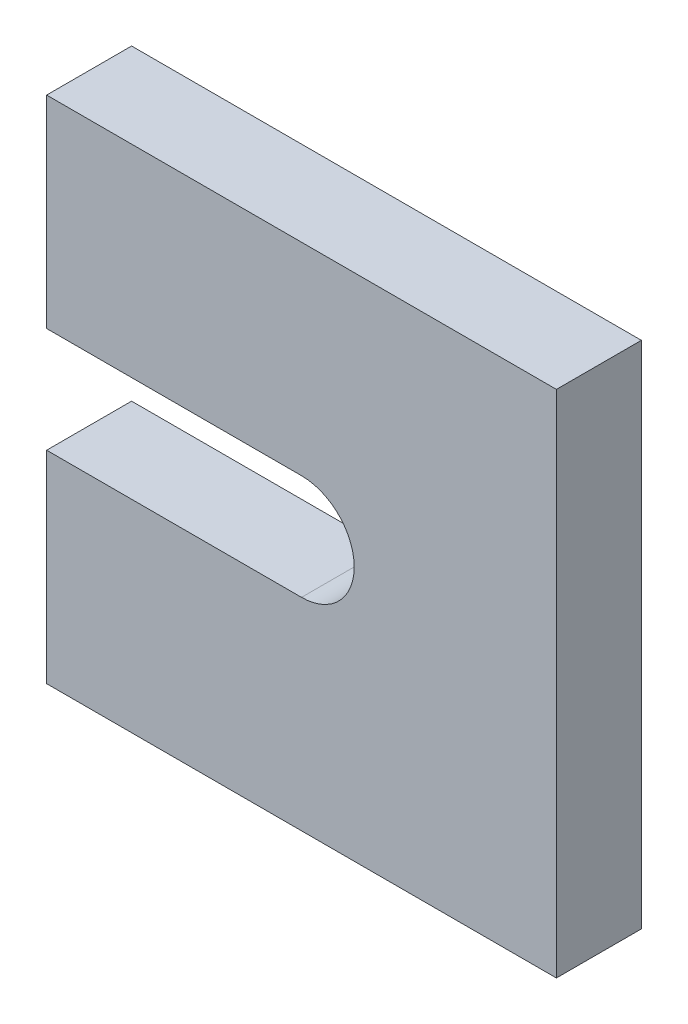
ISO-10303-21;
HEADER;
FILE_DESCRIPTION(('STEP AP214'),'2;1');
FILE_NAME('part.step','',(''),(''),'','','');
FILE_SCHEMA(('AUTOMOTIVE_DESIGN { 1 0 10303 214 1 1 1 1 }'));
ENDSEC;
DATA;
#1=APPLICATION_CONTEXT('core data for automotive mechanical design processes');
#2=APPLICATION_PROTOCOL_DEFINITION('international standard','automotive_design',2000,#1);
#3=PRODUCT_CONTEXT('',#1,'mechanical');
#4=PRODUCT('Part','Part','',(#3));
#5=PRODUCT_RELATED_PRODUCT_CATEGORY('part','',(#4));
#6=PRODUCT_DEFINITION_FORMATION('','',#4);
#7=PRODUCT_DEFINITION_CONTEXT('part definition',#1,'design');
#8=PRODUCT_DEFINITION('design','',#6,#7);
#9=PRODUCT_DEFINITION_SHAPE('','',#8);
#10=(LENGTH_UNIT() NAMED_UNIT(*) SI_UNIT(.MILLI.,.METRE.));
#11=(NAMED_UNIT(*) PLANE_ANGLE_UNIT() SI_UNIT($,.RADIAN.));
#12=(NAMED_UNIT(*) SI_UNIT($,.STERADIAN.) SOLID_ANGLE_UNIT());
#13=UNCERTAINTY_MEASURE_WITH_UNIT(LENGTH_MEASURE(1.E-05),#10,'distance_accuracy_value','');
#14=(GEOMETRIC_REPRESENTATION_CONTEXT(3) GLOBAL_UNCERTAINTY_ASSIGNED_CONTEXT((#13)) GLOBAL_UNIT_ASSIGNED_CONTEXT((#10,
#11,#12)) REPRESENTATION_CONTEXT('',''));
#15=CARTESIAN_POINT('',(0.,0.,0.));
#16=DIRECTION('',(0.,0.,1.));
#17=DIRECTION('',(1.,0.,0.));
#18=AXIS2_PLACEMENT_3D('',#15,#16,#17);
#19=CARTESIAN_POINT('',(0.,0.,5.));
#20=DIRECTION('',(1.,0.,0.));
#21=DIRECTION('',(0.,0.,-1.));
#22=AXIS2_PLACEMENT_3D('',#19,#20,#21);
#23=PLANE('',#22);
#24=DIRECTION('',(0.,-1.,0.));
#25=VECTOR('',#24,1.);
#26=CARTESIAN_POINT('',(0.,0.,0.));
#27=LINE('',#26,#25);
#28=CARTESIAN_POINT('',(0.,11.9,0.));
#29=VERTEX_POINT('',#28);
#30=CARTESIAN_POINT('',(0.,0.,0.));
#31=VERTEX_POINT('',#30);
#32=EDGE_CURVE('E129',#29,#31,#27,.T.);
#33=ORIENTED_EDGE('',*,*,#32,.T.);
#34=DIRECTION('',(0.,0.,-1.));
#35=VECTOR('',#34,1.);
#36=CARTESIAN_POINT('',(0.,0.,5.));
#37=LINE('',#36,#35);
#38=CARTESIAN_POINT('',(0.,0.,5.));
#39=VERTEX_POINT('',#38);
#40=EDGE_CURVE('E11',#39,#31,#37,.T.);
#41=ORIENTED_EDGE('',*,*,#40,.F.);
#42=DIRECTION('',(0.,-1.,0.));
#43=VECTOR('',#42,1.);
#44=CARTESIAN_POINT('',(0.,0.,5.));
#45=LINE('',#44,#43);
#46=CARTESIAN_POINT('',(0.,11.9,5.));
#47=VERTEX_POINT('',#46);
#48=EDGE_CURVE('E143',#47,#39,#45,.T.);
#49=ORIENTED_EDGE('',*,*,#48,.F.);
#50=DIRECTION('',(0.,0.,-1.));
#51=VECTOR('',#50,1.);
#52=CARTESIAN_POINT('',(0.,11.9,5.));
#53=LINE('',#52,#51);
#54=EDGE_CURVE('E125',#47,#29,#53,.T.);
#55=ORIENTED_EDGE('',*,*,#54,.T.);
#56=EDGE_LOOP('',(#33,#41,#49,#55));
#57=FACE_BOUND('',#56,.T.);
#58=ADVANCED_FACE('F33',(#57),#23,.F.);
#59=CARTESIAN_POINT('',(0.,0.,5.));
#60=DIRECTION('',(0.,1.,0.));
#61=DIRECTION('',(0.,0.,1.));
#62=AXIS2_PLACEMENT_3D('',#59,#60,#61);
#63=PLANE('',#62);
#64=DIRECTION('',(1.,0.,0.));
#65=VECTOR('',#64,1.);
#66=CARTESIAN_POINT('',(0.,0.,0.));
#67=LINE('',#66,#65);
#68=CARTESIAN_POINT('',(30.,0.,0.));
#69=VERTEX_POINT('',#68);
#70=EDGE_CURVE('E132',#31,#69,#67,.T.);
#71=ORIENTED_EDGE('',*,*,#70,.T.);
#72=DIRECTION('',(0.,0.,-1.));
#73=VECTOR('',#72,1.);
#74=CARTESIAN_POINT('',(30.,0.,5.));
#75=LINE('',#74,#73);
#76=CARTESIAN_POINT('',(30.,0.,5.));
#77=VERTEX_POINT('',#76);
#78=EDGE_CURVE('E41',#77,#69,#75,.T.);
#79=ORIENTED_EDGE('',*,*,#78,.F.);
#80=DIRECTION('',(1.,0.,0.));
#81=VECTOR('',#80,1.);
#82=CARTESIAN_POINT('',(0.,0.,5.));
#83=LINE('',#82,#81);
#84=EDGE_CURVE('E92',#39,#77,#83,.T.);
#85=ORIENTED_EDGE('',*,*,#84,.F.);
#86=ORIENTED_EDGE('',*,*,#40,.T.);
#87=EDGE_LOOP('',(#71,#79,#85,#86));
#88=FACE_BOUND('',#87,.T.);
#89=ADVANCED_FACE('F178',(#88),#63,.F.);
#90=CARTESIAN_POINT('',(30.,0.,5.));
#91=DIRECTION('',(-1.,0.,0.));
#92=DIRECTION('',(0.,-1.,0.));
#93=AXIS2_PLACEMENT_3D('',#90,#91,#92);
#94=PLANE('',#93);
#95=DIRECTION('',(0.,1.,0.));
#96=VECTOR('',#95,1.);
#97=CARTESIAN_POINT('',(30.,0.,0.));
#98=LINE('',#97,#96);
#99=CARTESIAN_POINT('',(30.,30.,0.));
#100=VERTEX_POINT('',#99);
#101=EDGE_CURVE('E134',#69,#100,#98,.T.);
#102=ORIENTED_EDGE('',*,*,#101,.T.);
#103=DIRECTION('',(0.,0.,-1.));
#104=VECTOR('',#103,1.);
#105=CARTESIAN_POINT('',(30.,30.,5.));
#106=LINE('',#105,#104);
#107=CARTESIAN_POINT('',(30.,30.,5.));
#108=VERTEX_POINT('',#107);
#109=EDGE_CURVE('E150',#108,#100,#106,.T.);
#110=ORIENTED_EDGE('',*,*,#109,.F.);
#111=DIRECTION('',(0.,1.,0.));
#112=VECTOR('',#111,1.);
#113=CARTESIAN_POINT('',(30.,0.,5.));
#114=LINE('',#113,#112);
#115=EDGE_CURVE('E158',#77,#108,#114,.T.);
#116=ORIENTED_EDGE('',*,*,#115,.F.);
#117=ORIENTED_EDGE('',*,*,#78,.T.);
#118=EDGE_LOOP('',(#102,#110,#116,#117));
#119=FACE_BOUND('',#118,.T.);
#120=ADVANCED_FACE('F156',(#119),#94,.F.);
#121=CARTESIAN_POINT('',(0.,30.,5.));
#122=DIRECTION('',(0.,-1.,0.));
#123=DIRECTION('',(0.,0.,-1.));
#124=AXIS2_PLACEMENT_3D('',#121,#122,#123);
#125=PLANE('',#124);
#126=DIRECTION('',(-1.,0.,0.));
#127=VECTOR('',#126,1.);
#128=CARTESIAN_POINT('',(0.,30.,0.));
#129=LINE('',#128,#127);
#130=CARTESIAN_POINT('',(0.,30.,0.));
#131=VERTEX_POINT('',#130);
#132=EDGE_CURVE('E136',#100,#131,#129,.T.);
#133=ORIENTED_EDGE('',*,*,#132,.T.);
#134=DIRECTION('',(0.,0.,-1.));
#135=VECTOR('',#134,1.);
#136=CARTESIAN_POINT('',(0.,30.,5.));
#137=LINE('',#136,#135);
#138=CARTESIAN_POINT('',(0.,30.,5.));
#139=VERTEX_POINT('',#138);
#140=EDGE_CURVE('E147',#139,#131,#137,.T.);
#141=ORIENTED_EDGE('',*,*,#140,.F.);
#142=DIRECTION('',(-1.,0.,0.));
#143=VECTOR('',#142,1.);
#144=CARTESIAN_POINT('',(0.,30.,5.));
#145=LINE('',#144,#143);
#146=EDGE_CURVE('E170',#108,#139,#145,.T.);
#147=ORIENTED_EDGE('',*,*,#146,.F.);
#148=ORIENTED_EDGE('',*,*,#109,.T.);
#149=EDGE_LOOP('',(#133,#141,#147,#148));
#150=FACE_BOUND('',#149,.T.);
#151=ADVANCED_FACE('F166',(#150),#125,.F.);
#152=CARTESIAN_POINT('',(0.,18.1,5.));
#153=DIRECTION('',(1.,0.,0.));
#154=DIRECTION('',(0.,0.,-1.));
#155=AXIS2_PLACEMENT_3D('',#152,#153,#154);
#156=PLANE('',#155);
#157=DIRECTION('',(0.,-1.,0.));
#158=VECTOR('',#157,1.);
#159=CARTESIAN_POINT('',(0.,18.1,0.));
#160=LINE('',#159,#158);
#161=CARTESIAN_POINT('',(0.,18.1,0.));
#162=VERTEX_POINT('',#161);
#163=EDGE_CURVE('E138',#131,#162,#160,.T.);
#164=ORIENTED_EDGE('',*,*,#163,.T.);
#165=DIRECTION('',(0.,0.,-1.));
#166=VECTOR('',#165,1.);
#167=CARTESIAN_POINT('',(0.,18.1,5.));
#168=LINE('',#167,#166);
#169=CARTESIAN_POINT('',(0.,18.1,5.));
#170=VERTEX_POINT('',#169);
#171=EDGE_CURVE('E120',#170,#162,#168,.T.);
#172=ORIENTED_EDGE('',*,*,#171,.F.);
#173=DIRECTION('',(0.,-1.,0.));
#174=VECTOR('',#173,1.);
#175=CARTESIAN_POINT('',(0.,18.1,5.));
#176=LINE('',#175,#174);
#177=EDGE_CURVE('E111',#139,#170,#176,.T.);
#178=ORIENTED_EDGE('',*,*,#177,.F.);
#179=ORIENTED_EDGE('',*,*,#140,.T.);
#180=EDGE_LOOP('',(#164,#172,#178,#179));
#181=FACE_BOUND('',#180,.T.);
#182=ADVANCED_FACE('F169',(#181),#156,.F.);
#183=CARTESIAN_POINT('',(15.,18.1,5.));
#184=DIRECTION('',(0.,1.,0.));
#185=DIRECTION('',(0.,0.,1.));
#186=AXIS2_PLACEMENT_3D('',#183,#184,#185);
#187=PLANE('',#186);
#188=DIRECTION('',(1.,0.,0.));
#189=VECTOR('',#188,1.);
#190=CARTESIAN_POINT('',(15.,18.1,0.));
#191=LINE('',#190,#189);
#192=CARTESIAN_POINT('',(15.,18.1,0.));
#193=VERTEX_POINT('',#192);
#194=EDGE_CURVE('E119',#162,#193,#191,.T.);
#195=ORIENTED_EDGE('',*,*,#194,.T.);
#196=DIRECTION('',(0.,0.,-1.));
#197=VECTOR('',#196,1.);
#198=CARTESIAN_POINT('',(15.,18.1,5.));
#199=LINE('',#198,#197);
#200=CARTESIAN_POINT('',(15.,18.1,5.));
#201=VERTEX_POINT('',#200);
#202=EDGE_CURVE('E116',#201,#193,#199,.T.);
#203=ORIENTED_EDGE('',*,*,#202,.F.);
#204=DIRECTION('',(1.,0.,0.));
#205=VECTOR('',#204,1.);
#206=CARTESIAN_POINT('',(15.,18.1,5.));
#207=LINE('',#206,#205);
#208=EDGE_CURVE('E105',#170,#201,#207,.T.);
#209=ORIENTED_EDGE('',*,*,#208,.F.);
#210=ORIENTED_EDGE('',*,*,#171,.T.);
#211=EDGE_LOOP('',(#195,#203,#209,#210));
#212=FACE_BOUND('',#211,.T.);
#213=ADVANCED_FACE('F117',(#212),#187,.F.);
#214=CARTESIAN_POINT('',(15.,15.,5.));
#215=DIRECTION('',(0.,0.,-1.));
#216=DIRECTION('',(-1.,0.,0.));
#217=AXIS2_PLACEMENT_3D('',#214,#215,#216);
#218=CYLINDRICAL_SURFACE('',#217,3.1);
#219=CARTESIAN_POINT('',(15.,15.,0.));
#220=DIRECTION('',(0.,0.,-1.));
#221=DIRECTION('',(1.,0.,0.));
#222=AXIS2_PLACEMENT_3D('',#219,#220,#221);
#223=CIRCLE('',#222,3.1);
#224=CARTESIAN_POINT('',(15.,11.9,0.));
#225=VERTEX_POINT('',#224);
#226=EDGE_CURVE('E78',#193,#225,#223,.T.);
#227=ORIENTED_EDGE('',*,*,#226,.T.);
#228=DIRECTION('',(0.,0.,-1.));
#229=VECTOR('',#228,1.);
#230=CARTESIAN_POINT('',(15.,11.9,5.));
#231=LINE('',#230,#229);
#232=CARTESIAN_POINT('',(15.,11.9,5.));
#233=VERTEX_POINT('',#232);
#234=EDGE_CURVE('E121',#233,#225,#231,.T.);
#235=ORIENTED_EDGE('',*,*,#234,.F.);
#236=CARTESIAN_POINT('',(15.,15.,5.));
#237=DIRECTION('',(0.,0.,-1.));
#238=DIRECTION('',(1.,0.,0.));
#239=AXIS2_PLACEMENT_3D('',#236,#237,#238);
#240=CIRCLE('',#239,3.1);
#241=EDGE_CURVE('E109',#201,#233,#240,.T.);
#242=ORIENTED_EDGE('',*,*,#241,.F.);
#243=ORIENTED_EDGE('',*,*,#202,.T.);
#244=EDGE_LOOP('',(#227,#235,#242,#243));
#245=FACE_BOUND('',#244,.T.);
#246=ADVANCED_FACE('F123',(#245),#218,.F.);
#247=CARTESIAN_POINT('',(15.,11.9,5.));
#248=DIRECTION('',(0.,-1.,0.));
#249=DIRECTION('',(0.,0.,-1.));
#250=AXIS2_PLACEMENT_3D('',#247,#248,#249);
#251=PLANE('',#250);
#252=DIRECTION('',(-1.,0.,0.));
#253=VECTOR('',#252,1.);
#254=CARTESIAN_POINT('',(15.,11.9,0.));
#255=LINE('',#254,#253);
#256=EDGE_CURVE('E84',#225,#29,#255,.T.);
#257=ORIENTED_EDGE('',*,*,#256,.T.);
#258=ORIENTED_EDGE('',*,*,#54,.F.);
#259=DIRECTION('',(-1.,0.,0.));
#260=VECTOR('',#259,1.);
#261=CARTESIAN_POINT('',(15.,11.9,5.));
#262=LINE('',#261,#260);
#263=EDGE_CURVE('E49',#233,#47,#262,.T.);
#264=ORIENTED_EDGE('',*,*,#263,.F.);
#265=ORIENTED_EDGE('',*,*,#234,.T.);
#266=EDGE_LOOP('',(#257,#258,#264,#265));
#267=FACE_BOUND('',#266,.T.);
#268=ADVANCED_FACE('F194',(#267),#251,.F.);
#269=CARTESIAN_POINT('',(15.,15.,5.));
#270=DIRECTION('',(0.,0.,1.));
#271=DIRECTION('',(1.,0.,0.));
#272=AXIS2_PLACEMENT_3D('',#269,#270,#271);
#273=PLANE('',#272);
#274=ORIENTED_EDGE('',*,*,#48,.T.);
#275=ORIENTED_EDGE('',*,*,#84,.T.);
#276=ORIENTED_EDGE('',*,*,#115,.T.);
#277=ORIENTED_EDGE('',*,*,#146,.T.);
#278=ORIENTED_EDGE('',*,*,#177,.T.);
#279=ORIENTED_EDGE('',*,*,#208,.T.);
#280=ORIENTED_EDGE('',*,*,#241,.T.);
#281=ORIENTED_EDGE('',*,*,#263,.T.);
#282=EDGE_LOOP('',(#274,#275,#276,#277,#278,#279,#280,#281));
#283=FACE_BOUND('',#282,.T.);
#284=ADVANCED_FACE('F107',(#283),#273,.T.);
#285=CARTESIAN_POINT('',(15.,15.,0.));
#286=DIRECTION('',(0.,0.,1.));
#287=DIRECTION('',(1.,0.,0.));
#288=AXIS2_PLACEMENT_3D('',#285,#286,#287);
#289=PLANE('',#288);
#290=ORIENTED_EDGE('',*,*,#32,.F.);
#291=ORIENTED_EDGE('',*,*,#256,.F.);
#292=ORIENTED_EDGE('',*,*,#226,.F.);
#293=ORIENTED_EDGE('',*,*,#194,.F.);
#294=ORIENTED_EDGE('',*,*,#163,.F.);
#295=ORIENTED_EDGE('',*,*,#132,.F.);
#296=ORIENTED_EDGE('',*,*,#101,.F.);
#297=ORIENTED_EDGE('',*,*,#70,.F.);
#298=EDGE_LOOP('',(#290,#291,#292,#293,#294,#295,#296,#297));
#299=FACE_BOUND('',#298,.T.);
#300=ADVANCED_FACE('F162',(#299),#289,.F.);
#301=CLOSED_SHELL('',(#58,#89,#120,#151,#182,#213,#246,#268,#284,#300));
#302=MANIFOLD_SOLID_BREP('B2',#301);
#303=ADVANCED_BREP_SHAPE_REPRESENTATION('',(#18,#302),#14);
#304=SHAPE_DEFINITION_REPRESENTATION(#9,#303);
ENDSEC;
END-ISO-10303-21;
